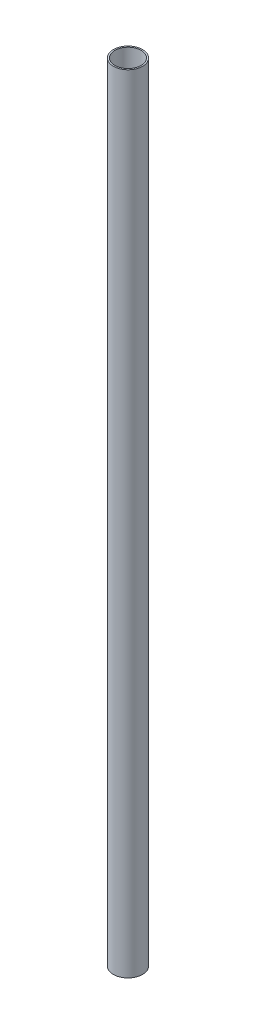
ISO-10303-21;
HEADER;
FILE_DESCRIPTION(('STEP AP214'),'2;1');
FILE_NAME('part.step','',(''),(''),'','','');
FILE_SCHEMA(('AUTOMOTIVE_DESIGN { 1 0 10303 214 1 1 1 1 }'));
ENDSEC;
DATA;
#1=APPLICATION_CONTEXT('core data for automotive mechanical design processes');
#2=APPLICATION_PROTOCOL_DEFINITION('international standard','automotive_design',2000,#1);
#3=PRODUCT_CONTEXT('',#1,'mechanical');
#4=PRODUCT('Part','Part','',(#3));
#5=PRODUCT_RELATED_PRODUCT_CATEGORY('part','',(#4));
#6=PRODUCT_DEFINITION_FORMATION('','',#4);
#7=PRODUCT_DEFINITION_CONTEXT('part definition',#1,'design');
#8=PRODUCT_DEFINITION('design','',#6,#7);
#9=PRODUCT_DEFINITION_SHAPE('','',#8);
#10=(LENGTH_UNIT() NAMED_UNIT(*) SI_UNIT(.MILLI.,.METRE.));
#11=(NAMED_UNIT(*) PLANE_ANGLE_UNIT() SI_UNIT($,.RADIAN.));
#12=(NAMED_UNIT(*) SI_UNIT($,.STERADIAN.) SOLID_ANGLE_UNIT());
#13=UNCERTAINTY_MEASURE_WITH_UNIT(LENGTH_MEASURE(1.E-05),#10,'distance_accuracy_value','');
#14=(GEOMETRIC_REPRESENTATION_CONTEXT(3) GLOBAL_UNCERTAINTY_ASSIGNED_CONTEXT((#13)) GLOBAL_UNIT_ASSIGNED_CONTEXT((#10,
#11,#12)) REPRESENTATION_CONTEXT('',''));
#15=CARTESIAN_POINT('',(0.,0.,0.));
#16=DIRECTION('',(0.,0.,1.));
#17=DIRECTION('',(1.,0.,0.));
#18=AXIS2_PLACEMENT_3D('',#15,#16,#17);
#19=CARTESIAN_POINT('',(0.,27.,0.));
#20=DIRECTION('',(0.,1.,0.));
#21=DIRECTION('',(0.,0.,1.));
#22=AXIS2_PLACEMENT_3D('',#19,#20,#21);
#23=PLANE('',#22);
#24=CARTESIAN_POINT('',(0.,27.,0.));
#25=DIRECTION('',(0.,1.,0.));
#26=DIRECTION('',(0.,0.,1.));
#27=AXIS2_PLACEMENT_3D('',#24,#25,#26);
#28=CIRCLE('',#27,0.5);
#29=CARTESIAN_POINT('',(0.,27.,0.5));
#30=VERTEX_POINT('',#29);
#31=EDGE_CURVE('E10',#30,#30,#28,.T.);
#32=ORIENTED_EDGE('',*,*,#31,.T.);
#33=EDGE_LOOP('',(#32));
#34=FACE_BOUND('',#33,.T.);
#35=CARTESIAN_POINT('',(0.,27.,0.));
#36=DIRECTION('',(0.,1.,0.));
#37=DIRECTION('',(0.,0.,1.));
#38=AXIS2_PLACEMENT_3D('',#35,#36,#37);
#39=CIRCLE('',#38,0.45);
#40=CARTESIAN_POINT('',(0.,27.,0.45));
#41=VERTEX_POINT('',#40);
#42=EDGE_CURVE('E46',#41,#41,#39,.T.);
#43=ORIENTED_EDGE('',*,*,#42,.F.);
#44=EDGE_LOOP('',(#43));
#45=FACE_BOUND('',#44,.T.);
#46=ADVANCED_FACE('F34',(#34,#45),#23,.T.);
#47=CARTESIAN_POINT('',(0.,0.,0.));
#48=DIRECTION('',(0.,1.,0.));
#49=DIRECTION('',(0.,0.,1.));
#50=AXIS2_PLACEMENT_3D('',#47,#48,#49);
#51=PLANE('',#50);
#52=CARTESIAN_POINT('',(0.,0.,0.));
#53=DIRECTION('',(0.,1.,0.));
#54=DIRECTION('',(0.,0.,1.));
#55=AXIS2_PLACEMENT_3D('',#52,#53,#54);
#56=CIRCLE('',#55,0.5);
#57=CARTESIAN_POINT('',(0.,0.,0.5));
#58=VERTEX_POINT('',#57);
#59=EDGE_CURVE('E39',#58,#58,#56,.T.);
#60=ORIENTED_EDGE('',*,*,#59,.F.);
#61=EDGE_LOOP('',(#60));
#62=FACE_BOUND('',#61,.T.);
#63=CARTESIAN_POINT('',(0.,0.,0.));
#64=DIRECTION('',(0.,1.,0.));
#65=DIRECTION('',(0.,0.,1.));
#66=AXIS2_PLACEMENT_3D('',#63,#64,#65);
#67=CIRCLE('',#66,0.45);
#68=CARTESIAN_POINT('',(0.,0.,0.45));
#69=VERTEX_POINT('',#68);
#70=EDGE_CURVE('E48',#69,#69,#67,.T.);
#71=ORIENTED_EDGE('',*,*,#70,.T.);
#72=EDGE_LOOP('',(#71));
#73=FACE_BOUND('',#72,.T.);
#74=ADVANCED_FACE('F75',(#62,#73),#51,.F.);
#75=CARTESIAN_POINT('',(0.,27.,0.));
#76=DIRECTION('',(0.,-1.,0.));
#77=DIRECTION('',(0.,0.,-1.));
#78=AXIS2_PLACEMENT_3D('',#75,#76,#77);
#79=CYLINDRICAL_SURFACE('',#78,0.5);
#80=CARTESIAN_POINT('',(0.,15.0599260781396,-0.5));
#81=CARTESIAN_POINT('',(-0.0130687405971079,15.0602431086734,-0.499999284397319));
#82=CARTESIAN_POINT('',(-0.0261776018533731,15.0595314674071,-0.499482183346041));
#83=CARTESIAN_POINT('',(-0.0520590129046771,15.0560787456185,-0.497452636192285));
#84=CARTESIAN_POINT('',(-0.0648309223805699,15.053334054152,-0.49593841962325));
#85=CARTESIAN_POINT('',(-0.0896239120042474,15.0459501821895,-0.49206143155771));
#86=CARTESIAN_POINT('',(-0.101647532498621,15.0413178658077,-0.489701738246784));
#87=CARTESIAN_POINT('',(-0.12471712373678,15.0303318529036,-0.484340890382829));
#88=CARTESIAN_POINT('',(-0.135763151760689,15.0239782573249,-0.481339773448));
#89=CARTESIAN_POINT('',(-0.157275681558225,15.0093238905417,-0.474760969070735));
#90=CARTESIAN_POINT('',(-0.167673611030449,15.000933005914,-0.471160212425725));
#91=CARTESIAN_POINT('',(-0.186981585823429,14.9826214165534,-0.463836948870498));
#92=CARTESIAN_POINT('',(-0.19589052768106,14.9726995876444,-0.460114354089743));
#93=CARTESIAN_POINT('',(-0.212731477233477,14.9506137933225,-0.452589658046664));
#94=CARTESIAN_POINT('',(-0.220518037368855,14.9383313756371,-0.448807260495963));
#95=CARTESIAN_POINT('',(-0.233905777593569,14.9124382860135,-0.441978345828607));
#96=CARTESIAN_POINT('',(-0.239508047766033,14.8988282808666,-0.438931461939311));
#97=CARTESIAN_POINT('',(-0.248076109685941,14.8712894195727,-0.434144545782209));
#98=CARTESIAN_POINT('',(-0.251152512968562,14.8574049147717,-0.432350270726179));
#99=CARTESIAN_POINT('',(-0.254913315477513,14.8292140818069,-0.430144585100165));
#100=CARTESIAN_POINT('',(-0.255600464716143,14.8149082577257,-0.429731584714976));
#101=CARTESIAN_POINT('',(-0.254611220001515,14.7881919769786,-0.430317341582915));
#102=CARTESIAN_POINT('',(-0.253216764385989,14.7757660285644,-0.43114773471273));
#103=CARTESIAN_POINT('',(-0.248635294144277,14.7513598579255,-0.433805739197923));
#104=CARTESIAN_POINT('',(-0.245447741774136,14.7393797705627,-0.435633649700639));
#105=CARTESIAN_POINT('',(-0.237378497741717,14.7160583735207,-0.440082526015176));
#106=CARTESIAN_POINT('',(-0.232483606885439,14.704722865132,-0.442709649591787));
#107=CARTESIAN_POINT('',(-0.221153671196261,14.6829927528248,-0.448476761823108));
#108=CARTESIAN_POINT('',(-0.214717993430506,14.6725985380007,-0.45161696107307));
#109=CARTESIAN_POINT('',(-0.199547388299089,14.6516698856591,-0.458539688367242));
#110=CARTESIAN_POINT('',(-0.190625434188534,14.6412809660477,-0.462353404796399));
#111=CARTESIAN_POINT('',(-0.171180155602426,14.6220836764971,-0.469900163352473));
#112=CARTESIAN_POINT('',(-0.160655960127447,14.6132761719459,-0.473633160331017));
#113=CARTESIAN_POINT('',(-0.137535812208262,14.59699057975,-0.480873056799112));
#114=CARTESIAN_POINT('',(-0.124854439719656,14.5896210778275,-0.484353765100492));
#115=CARTESIAN_POINT('',(-0.0982202352461421,14.5771771172148,-0.490447594237901));
#116=CARTESIAN_POINT('',(-0.0842683228424406,14.5721010142424,-0.493061336298128));
#117=CARTESIAN_POINT('',(-0.0566087674253749,14.5647797816459,-0.496966359714166));
#118=CARTESIAN_POINT('',(-0.0429622526949473,14.5623498028946,-0.498342608405552));
#119=CARTESIAN_POINT('',(-0.0153912241485817,14.5597902962006,-0.499953375844379));
#120=CARTESIAN_POINT('',(-0.00146686832960867,14.5596594961443,-0.500188525898676));
#121=CARTESIAN_POINT('',(0.0250154405869219,14.5616154303193,-0.499534805532417));
#122=CARTESIAN_POINT('',(0.0375900062404483,14.5635170066196,-0.498738598759838));
#123=CARTESIAN_POINT('',(0.0622251223147617,14.5691666499727,-0.496267401288213));
#124=CARTESIAN_POINT('',(0.0742856281507444,14.5729148768343,-0.494592334531973));
#125=CARTESIAN_POINT('',(0.0978262976398352,14.5822022385959,-0.490485094588233));
#126=CARTESIAN_POINT('',(0.109291023999279,14.5877741379572,-0.488039103084186));
#127=CARTESIAN_POINT('',(0.131160676953078,14.6005114978656,-0.482622001350253));
#128=CARTESIAN_POINT('',(0.141565197808523,14.6076775651835,-0.479650691262711));
#129=CARTESIAN_POINT('',(0.162081052561194,14.6241918003976,-0.473134658613066));
#130=CARTESIAN_POINT('',(0.172068241865524,14.6336834463642,-0.469562271913127));
#131=CARTESIAN_POINT('',(0.190372307490366,14.6541803463061,-0.462444621157885));
#132=CARTESIAN_POINT('',(0.198687931339629,14.6651867249158,-0.458899379340722));
#133=CARTESIAN_POINT('',(0.213880685542216,14.6891963253733,-0.452027275527825));
#134=CARTESIAN_POINT('',(0.220645142265048,14.7022787146691,-0.448725338160548));
#135=CARTESIAN_POINT('',(0.231807767227097,14.7296034700236,-0.443062957206013));
#136=CARTESIAN_POINT('',(0.236208628749406,14.7438444944266,-0.440701442817151));
#137=CARTESIAN_POINT('',(0.24213886158658,14.7717942034951,-0.437469235890071));
#138=CARTESIAN_POINT('',(0.243881351049397,14.7854444976997,-0.436488455674465));
#139=CARTESIAN_POINT('',(0.245078780899116,14.8128733826924,-0.435817677021396));
#140=CARTESIAN_POINT('',(0.244535112681578,14.8266518903535,-0.436126893468492));
#141=CARTESIAN_POINT('',(0.241375831593556,14.852410296605,-0.437881509874171));
#142=CARTESIAN_POINT('',(0.238983556257997,14.8644272464488,-0.43920431716041));
#143=CARTESIAN_POINT('',(0.232508628727898,14.8878721529293,-0.442665922435649));
#144=CARTESIAN_POINT('',(0.228425425351653,14.8992999161453,-0.444804986477113));
#145=CARTESIAN_POINT('',(0.218448447005977,14.9219340016363,-0.449792023760454));
#146=CARTESIAN_POINT('',(0.212469010563156,14.9330952579096,-0.452671969819556));
#147=CARTESIAN_POINT('',(0.198953720458618,14.9543292121428,-0.458772672692665));
#148=CARTESIAN_POINT('',(0.191417116155483,14.9644013815219,-0.461993593508934));
#149=CARTESIAN_POINT('',(0.173904547083895,14.9844837666293,-0.468888392134496));
#150=CARTESIAN_POINT('',(0.163741556883157,14.9943294860322,-0.472568647981121));
#151=CARTESIAN_POINT('',(0.141831847393414,15.0122324942431,-0.479599874340502));
#152=CARTESIAN_POINT('',(0.130084106209135,15.0202886201211,-0.482950629950936));
#153=CARTESIAN_POINT('',(0.105006585342082,15.0345044712754,-0.489022842385211));
#154=CARTESIAN_POINT('',(0.0916496490052845,15.0406226160315,-0.491730224947188));
#155=CARTESIAN_POINT('',(0.0639386696291986,15.0504555280152,-0.496091764604699));
#156=CARTESIAN_POINT('',(0.0495875723723831,15.0541770853236,-0.497748897085902));
#157=CARTESIAN_POINT('',(0.029220805356604,15.0575666430219,-0.499179413268877));
#158=CARTESIAN_POINT('',(0.0234061520878796,15.0583253029916,-0.499486031415215));
#159=CARTESIAN_POINT('',(0.0117303647929215,15.0594338408633,-0.499896490536177));
#160=CARTESIAN_POINT('',(0.0058692284592487,15.0597836983427,-0.500000321380288));
#161=CARTESIAN_POINT('',(0.,15.0599260781396,-0.5));
#162=B_SPLINE_CURVE_WITH_KNOTS('',3,(#80,#81,#82,#83,#84,#85,#86,#87,#88,#89,#90,#91,#92,#93,
#94,#95,#96,#97,#98,#99,#100,#101,#102,#103,#104,#105,#106,#107,#108,#109,#110,#111,#112,#113,
#114,#115,#116,#117,#118,#119,#120,#121,#122,#123,#124,#125,#126,#127,#128,#129,#130,#131,#132,
#133,#134,#135,#136,#137,#138,#139,#140,#141,#142,#143,#144,#145,#146,#147,#148,#149,#150,#151,
#152,#153,#154,#155,#156,#157,#158,#159,#160,#161),.UNSPECIFIED.,.T.,.F.,(4,2,2,2,2,2,2,2,2,2,2,
2,2,2,2,2,2,2,2,2,2,2,2,2,2,2,2,2,2,2,2,2,2,2,2,2,2,2,2,2,4),(0.,0.0391941285804924,
0.078458038125048,0.117580425658553,0.156700519372408,0.198043019816072,0.239416023914352,
0.284273111137494,0.329107783417861,0.371854913304272,0.414552825269421,0.451967397877446,
0.489393196982037,0.527114988421286,0.56485230209177,0.607316534500517,0.649803933997391,
0.694788956447591,0.739741674917103,0.78129946809849,0.822834267024693,0.86088377546017,
0.898936577271591,0.937714467457849,0.976507142579664,1.01902578664445,1.06157617130902,
1.10661687592344,1.15160614781602,1.19275356782435,1.23387594841877,1.27068444060148,
1.30750494048432,1.34630829837046,1.38513040545634,1.42879585446983,1.47248959608935,
1.51706567609554,1.56151489966418,1.57911627465022,1.59671852891419),.UNSPECIFIED.);
#163=CARTESIAN_POINT('',(0.,15.0599260781396,-0.5));
#164=VERTEX_POINT('',#163);
#165=EDGE_CURVE('E51',#164,#164,#162,.T.);
#166=ORIENTED_EDGE('',*,*,#165,.T.);
#167=EDGE_LOOP('',(#166));
#168=FACE_BOUND('',#167,.T.);
#169=ORIENTED_EDGE('',*,*,#31,.F.);
#170=EDGE_LOOP('',(#169));
#171=FACE_BOUND('',#170,.T.);
#172=ORIENTED_EDGE('',*,*,#59,.T.);
#173=EDGE_LOOP('',(#172));
#174=FACE_BOUND('',#173,.T.);
#175=ADVANCED_FACE('F36',(#168,#171,#174),#79,.T.);
#176=CARTESIAN_POINT('',(0.,27.,0.));
#177=DIRECTION('',(0.,-1.,0.));
#178=DIRECTION('',(0.,0.,-1.));
#179=AXIS2_PLACEMENT_3D('',#176,#177,#178);
#180=CYLINDRICAL_SURFACE('',#179,0.45);
#181=CARTESIAN_POINT('',(0.,15.0599401249754,-0.45));
#182=CARTESIAN_POINT('',(-0.0128984394084565,15.0602229980953,-0.450000479050531));
#183=CARTESIAN_POINT('',(-0.0258158294129288,15.0595023482999,-0.449440828655682));
#184=CARTESIAN_POINT('',(-0.0512942044087638,15.0560955432755,-0.447249777234769));
#185=CARTESIAN_POINT('',(-0.063855168468018,15.0534092728571,-0.445618313398801));
#186=CARTESIAN_POINT('',(-0.0882283213538681,15.0462134121841,-0.441438963389266));
#187=CARTESIAN_POINT('',(-0.100042888827551,15.0417099912807,-0.438894181194271));
#188=CARTESIAN_POINT('',(-0.122714237264954,15.0310561226835,-0.433103102568131));
#189=CARTESIAN_POINT('',(-0.133570769886339,15.0249052495938,-0.429856624990995));
#190=CARTESIAN_POINT('',(-0.154817465653528,15.010685685497,-0.422688229888939));
#191=CARTESIAN_POINT('',(-0.165130982968042,15.0025180488274,-0.418736062943716));
#192=CARTESIAN_POINT('',(-0.184317696497799,14.9846999519432,-0.410652640252605));
#193=CARTESIAN_POINT('',(-0.193189481391042,14.9750480565478,-0.406521213980221));
#194=CARTESIAN_POINT('',(-0.210216886692234,14.9533105423901,-0.398006119213953));
#195=CARTESIAN_POINT('',(-0.218192547540669,14.9410747772635,-0.393643186971586));
#196=CARTESIAN_POINT('',(-0.231964520764578,14.9152065906746,-0.385688971419343));
#197=CARTESIAN_POINT('',(-0.237763438194111,14.9015758636915,-0.382096767947955));
#198=CARTESIAN_POINT('',(-0.245999845333308,14.8760895384401,-0.376832890265223));
#199=CARTESIAN_POINT('',(-0.248878294808788,14.8644263828742,-0.374920505790739));
#200=CARTESIAN_POINT('',(-0.25294450946747,14.840688528813,-0.372189843862363));
#201=CARTESIAN_POINT('',(-0.25413408896539,14.8286142862449,-0.371370392352795));
#202=CARTESIAN_POINT('',(-0.254759940122677,14.8043754813961,-0.370941447314124));
#203=CARTESIAN_POINT('',(-0.254192918753097,14.7922107921787,-0.371334226299552));
#204=CARTESIAN_POINT('',(-0.25133146014893,14.7681788374661,-0.373276478800635));
#205=CARTESIAN_POINT('',(-0.249036009140329,14.7563117507459,-0.374826631144756));
#206=CARTESIAN_POINT('',(-0.242882958258783,14.7333730411858,-0.378841558635644));
#207=CARTESIAN_POINT('',(-0.239051313723061,14.7222916346606,-0.381291082887192));
#208=CARTESIAN_POINT('',(-0.229962829728809,14.7009071462764,-0.386840242650974));
#209=CARTESIAN_POINT('',(-0.224705461677163,14.6906043549075,-0.389940119187428));
#210=CARTESIAN_POINT('',(-0.212032102465392,14.6694798190717,-0.396991405562111));
#211=CARTESIAN_POINT('',(-0.204413797047065,14.6587988604572,-0.401001123847089));
#212=CARTESIAN_POINT('',(-0.187620506559373,14.638777370917,-0.409127943073518));
#213=CARTESIAN_POINT('',(-0.178444269064577,14.6294379296802,-0.413245128136352));
#214=CARTESIAN_POINT('',(-0.15753777271593,14.6112828216585,-0.421690507839207));
#215=CARTESIAN_POINT('',(-0.145635374180525,14.6026496106669,-0.425988874423069));
#216=CARTESIAN_POINT('',(-0.12030357379514,14.5875395405772,-0.433823009843068));
#217=CARTESIAN_POINT('',(-0.10687493269729,14.5810616134518,-0.437359156082277));
#218=CARTESIAN_POINT('',(-0.0796555124959961,14.5708668577298,-0.443099300639006));
#219=CARTESIAN_POINT('',(-0.0659307878745748,14.5670118064964,-0.445368608605502));
#220=CARTESIAN_POINT('',(-0.0378813209184581,14.5617010374426,-0.448624147193542));
#221=CARTESIAN_POINT('',(-0.0235571785107598,14.5602429768292,-0.449611630457854));
#222=CARTESIAN_POINT('',(0.00346184394570258,14.5598380624066,-0.45016550784262));
#223=CARTESIAN_POINT('',(0.0161504257693592,14.5606163047864,-0.449885228600454));
#224=CARTESIAN_POINT('',(0.0411986626512604,14.5640657259016,-0.448285736232218));
#225=CARTESIAN_POINT('',(0.0535583205011474,14.566736888566,-0.446966531926619));
#226=CARTESIAN_POINT('',(0.0774254359344494,14.5737917280194,-0.443450945749376));
#227=CARTESIAN_POINT('',(0.0889432239922978,14.5781478697425,-0.441268655714151));
#228=CARTESIAN_POINT('',(0.111098895205677,14.5884128314464,-0.436218182155493));
#229=CARTESIAN_POINT('',(0.121736570244254,14.5943220172976,-0.433349837023605));
#230=CARTESIAN_POINT('',(0.142941311816325,14.6081709702786,-0.426851690124986));
#231=CARTESIAN_POINT('',(0.153401557062174,14.6162520555032,-0.423175026633223));
#232=CARTESIAN_POINT('',(0.172897932659432,14.633902373881,-0.415591116940912));
#233=CARTESIAN_POINT('',(0.18193254022033,14.6434731768919,-0.411683630226496));
#234=CARTESIAN_POINT('',(0.199308859997474,14.6650417735822,-0.403580701199023));
#235=CARTESIAN_POINT('',(0.207471921020744,14.6771898322722,-0.399399409024842));
#236=CARTESIAN_POINT('',(0.22161924463976,14.7028903767692,-0.391726858335009));
#237=CARTESIAN_POINT('',(0.227606018376917,14.7164412205967,-0.388234806669986));
#238=CARTESIAN_POINT('',(0.236186393336413,14.7418454359263,-0.383061343630769));
#239=CARTESIAN_POINT('',(0.239216470527157,14.7535060372111,-0.381158607248781));
#240=CARTESIAN_POINT('',(0.243557055662442,14.7772591566803,-0.378400293496536));
#241=CARTESIAN_POINT('',(0.24486943703057,14.7893511895022,-0.377543575343764));
#242=CARTESIAN_POINT('',(0.245703864912188,14.8136497624975,-0.377001211697832));
#243=CARTESIAN_POINT('',(0.245222142568735,14.8258564899299,-0.377318031437195));
#244=CARTESIAN_POINT('',(0.24248897438985,14.8499888817259,-0.379079923492943));
#245=CARTESIAN_POINT('',(0.240236532155311,14.861914383949,-0.380525631041001));
#246=CARTESIAN_POINT('',(0.234144511868688,14.8849227062589,-0.384302872886247));
#247=CARTESIAN_POINT('',(0.2303391889431,14.8960179496723,-0.386615205567036));
#248=CARTESIAN_POINT('',(0.221286214171404,14.9174412842632,-0.391866968466637));
#249=CARTESIAN_POINT('',(0.21603803270821,14.9277690919735,-0.394806628864145));
#250=CARTESIAN_POINT('',(0.203387801388966,14.9489334275022,-0.40148655838814));
#251=CARTESIAN_POINT('',(0.195785496447964,14.9596330991629,-0.405281226371706));
#252=CARTESIAN_POINT('',(0.179027148516503,14.979710477181,-0.412958030469403));
#253=CARTESIAN_POINT('',(0.16986985759415,14.9890871105989,-0.416840234647129));
#254=CARTESIAN_POINT('',(0.148978839942063,15.0073744501548,-0.424787364732618));
#255=CARTESIAN_POINT('',(0.137068585688295,15.0160995248455,-0.428819770860701));
#256=CARTESIAN_POINT('',(0.11172791774839,15.0314125561561,-0.436108145318829));
#257=CARTESIAN_POINT('',(0.0982981696317233,15.0380014436187,-0.43936445166972));
#258=CARTESIAN_POINT('',(0.07097990974078,15.0484704529239,-0.444573026897851));
#259=CARTESIAN_POINT('',(0.0571488757705993,15.0524706327889,-0.446582878044056));
#260=CARTESIAN_POINT('',(0.0288860915765994,15.0580457731449,-0.449295453967212));
#261=CARTESIAN_POINT('',(0.0144549459122241,15.0596231164197,-0.449999463140517));
#262=CARTESIAN_POINT('',(0.,15.0599401249754,-0.45));
#263=B_SPLINE_CURVE_WITH_KNOTS('',3,(#181,#182,#183,#184,#185,#186,#187,#188,#189,#190,#191,
#192,#193,#194,#195,#196,#197,#198,#199,#200,#201,#202,#203,#204,#205,#206,#207,#208,#209,#210,
#211,#212,#213,#214,#215,#216,#217,#218,#219,#220,#221,#222,#223,#224,#225,#226,#227,#228,#229,
#230,#231,#232,#233,#234,#235,#236,#237,#238,#239,#240,#241,#242,#243,#244,#245,#246,#247,#248,
#249,#250,#251,#252,#253,#254,#255,#256,#257,#258,#259,#260,#261,#262),.UNSPECIFIED.,.T.,.F.,(4,
2,2,2,2,2,2,2,2,2,2,2,2,2,2,2,2,2,2,2,2,2,2,2,2,2,2,2,2,2,2,2,2,2,2,2,2,2,2,2,4),(0.,
0.0386494876471066,0.0773012404151902,0.115822857350995,0.154354430727852,0.195400043106253,
0.236485596391798,0.281994847546706,0.327449459773885,0.363785530223462,0.400082536042776,
0.436447627546476,0.472834064859341,0.508630016774494,0.544439258379841,0.585432388156784,
0.626458629817969,0.672183011102608,0.71788470030796,0.760938632051097,0.803950458271935,
0.841909042278608,0.879867304020515,0.917229828574523,0.954601162999551,0.99559545677141,
1.03663324631911,1.0820788404402,1.12747182877906,1.16390649394701,1.20030138804675,
1.23677277964283,1.27326470870321,1.30899178400431,1.34473199087046,1.38555973830209,
1.42642040767093,1.47210403587423,1.51776773061817,1.56112387398864,1.60443735058704),.UNSPECIFIED.);
#264=CARTESIAN_POINT('',(0.,15.0599401249754,-0.45));
#265=VERTEX_POINT('',#264);
#266=EDGE_CURVE('E59',#265,#265,#263,.T.);
#267=ORIENTED_EDGE('',*,*,#266,.F.);
#268=EDGE_LOOP('',(#267));
#269=FACE_BOUND('',#268,.T.);
#270=ORIENTED_EDGE('',*,*,#42,.T.);
#271=EDGE_LOOP('',(#270));
#272=FACE_BOUND('',#271,.T.);
#273=ORIENTED_EDGE('',*,*,#70,.F.);
#274=EDGE_LOOP('',(#273));
#275=FACE_BOUND('',#274,.T.);
#276=ADVANCED_FACE('F66',(#269,#272,#275),#180,.F.);
#277=CARTESIAN_POINT('',(-0.0060791007355875,14.81,-0.499963043168439));
#278=DIRECTION('',(-0.0121582014711755,0.,-0.999926086336878));
#279=DIRECTION('',(-0.999926086336879,0.,0.0121582014711755));
#280=AXIS2_PLACEMENT_3D('',#277,#278,#279);
#281=CYLINDRICAL_SURFACE('',#280,0.25);
#282=ORIENTED_EDGE('',*,*,#266,.T.);
#283=EDGE_LOOP('',(#282));
#284=FACE_BOUND('',#283,.T.);
#285=ORIENTED_EDGE('',*,*,#165,.F.);
#286=EDGE_LOOP('',(#285));
#287=FACE_BOUND('',#286,.T.);
#288=ADVANCED_FACE('F63',(#284,#287),#281,.F.);
#289=CLOSED_SHELL('',(#46,#74,#175,#276,#288));
#290=MANIFOLD_SOLID_BREP('B2',#289);
#291=ADVANCED_BREP_SHAPE_REPRESENTATION('',(#18,#290),#14);
#292=SHAPE_DEFINITION_REPRESENTATION(#9,#291);
ENDSEC;
END-ISO-10303-21;
